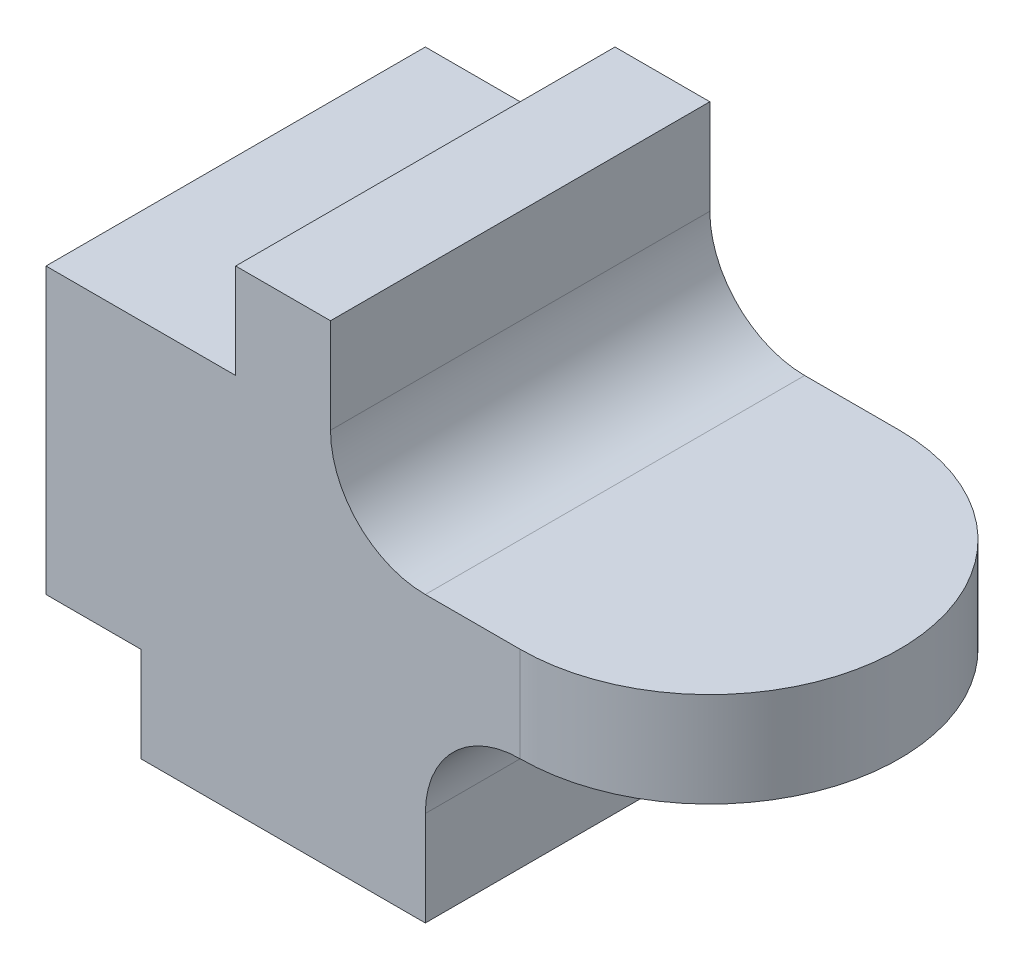
ISO-10303-21;
HEADER;
FILE_DESCRIPTION(('STEP AP214'),'2;1');
FILE_NAME('part.step','',(''),(''),'','','');
FILE_SCHEMA(('AUTOMOTIVE_DESIGN { 1 0 10303 214 1 1 1 1 }'));
ENDSEC;
DATA;
#1=APPLICATION_CONTEXT('core data for automotive mechanical design processes');
#2=APPLICATION_PROTOCOL_DEFINITION('international standard','automotive_design',2000,#1);
#3=PRODUCT_CONTEXT('',#1,'mechanical');
#4=PRODUCT('Part','Part','',(#3));
#5=PRODUCT_RELATED_PRODUCT_CATEGORY('part','',(#4));
#6=PRODUCT_DEFINITION_FORMATION('','',#4);
#7=PRODUCT_DEFINITION_CONTEXT('part definition',#1,'design');
#8=PRODUCT_DEFINITION('design','',#6,#7);
#9=PRODUCT_DEFINITION_SHAPE('','',#8);
#10=(LENGTH_UNIT() NAMED_UNIT(*) SI_UNIT(.MILLI.,.METRE.));
#11=(NAMED_UNIT(*) PLANE_ANGLE_UNIT() SI_UNIT($,.RADIAN.));
#12=(NAMED_UNIT(*) SI_UNIT($,.STERADIAN.) SOLID_ANGLE_UNIT());
#13=UNCERTAINTY_MEASURE_WITH_UNIT(LENGTH_MEASURE(1.E-05),#10,'distance_accuracy_value','');
#14=(GEOMETRIC_REPRESENTATION_CONTEXT(3) GLOBAL_UNCERTAINTY_ASSIGNED_CONTEXT((#13)) GLOBAL_UNIT_ASSIGNED_CONTEXT((#10,
#11,#12)) REPRESENTATION_CONTEXT('',''));
#15=CARTESIAN_POINT('',(0.,0.,0.));
#16=DIRECTION('',(0.,0.,1.));
#17=DIRECTION('',(1.,0.,0.));
#18=AXIS2_PLACEMENT_3D('',#15,#16,#17);
#19=CARTESIAN_POINT('',(0.,20.,-20.));
#20=DIRECTION('',(0.,1.,0.));
#21=DIRECTION('',(-1.,0.,0.));
#22=AXIS2_PLACEMENT_3D('',#19,#20,#21);
#23=PLANE('',#22);
#24=CARTESIAN_POINT('',(15.,20.,0.));
#25=DIRECTION('',(0.,1.,0.));
#26=DIRECTION('',(-1.,0.,0.));
#27=AXIS2_PLACEMENT_3D('',#24,#25,#26);
#28=CIRCLE('',#27,20.);
#29=CARTESIAN_POINT('',(15.,20.,-20.));
#30=VERTEX_POINT('',#29);
#31=CARTESIAN_POINT('',(15.,20.,20.));
#32=VERTEX_POINT('',#31);
#33=EDGE_CURVE('E188',#30,#32,#28,.F.);
#34=ORIENTED_EDGE('',*,*,#33,.T.);
#35=DIRECTION('',(0.,0.,1.));
#36=VECTOR('',#35,1.);
#37=CARTESIAN_POINT('',(15.,20.,-20.));
#38=LINE('',#37,#36);
#39=EDGE_CURVE('E170',#30,#32,#38,.T.);
#40=ORIENTED_EDGE('',*,*,#39,.F.);
#41=EDGE_LOOP('',(#34,#40));
#42=FACE_BOUND('',#41,.T.);
#43=ADVANCED_FACE('F33',(#42),#23,.F.);
#44=CARTESIAN_POINT('',(0.,30.,-20.));
#45=DIRECTION('',(0.,1.,0.));
#46=DIRECTION('',(-1.,0.,0.));
#47=AXIS2_PLACEMENT_3D('',#44,#45,#46);
#48=PLANE('',#47);
#49=DIRECTION('',(-1.,0.,0.));
#50=VECTOR('',#49,1.);
#51=CARTESIAN_POINT('',(0.,30.,20.));
#52=LINE('',#51,#50);
#53=CARTESIAN_POINT('',(15.,30.,20.));
#54=VERTEX_POINT('',#53);
#55=CARTESIAN_POINT('',(4.99999999999998,30.,20.));
#56=VERTEX_POINT('',#55);
#57=EDGE_CURVE('E137',#54,#56,#52,.T.);
#58=ORIENTED_EDGE('',*,*,#57,.F.);
#59=CARTESIAN_POINT('',(15.,30.,0.));
#60=DIRECTION('',(0.,1.,0.));
#61=DIRECTION('',(-1.,0.,0.));
#62=AXIS2_PLACEMENT_3D('',#59,#60,#61);
#63=CIRCLE('',#62,20.);
#64=CARTESIAN_POINT('',(15.,30.,-20.));
#65=VERTEX_POINT('',#64);
#66=EDGE_CURVE('E12',#65,#54,#63,.F.);
#67=ORIENTED_EDGE('',*,*,#66,.F.);
#68=DIRECTION('',(-1.,0.,0.));
#69=VECTOR('',#68,1.);
#70=CARTESIAN_POINT('',(0.,30.,-20.));
#71=LINE('',#70,#69);
#72=CARTESIAN_POINT('',(4.99999999999998,30.,-20.));
#73=VERTEX_POINT('',#72);
#74=EDGE_CURVE('E163',#65,#73,#71,.T.);
#75=ORIENTED_EDGE('',*,*,#74,.T.);
#76=DIRECTION('',(0.,0.,1.));
#77=VECTOR('',#76,1.);
#78=CARTESIAN_POINT('',(4.99999999999998,30.,-20.));
#79=LINE('',#78,#77);
#80=EDGE_CURVE('E145',#73,#56,#79,.T.);
#81=ORIENTED_EDGE('',*,*,#80,.T.);
#82=EDGE_LOOP('',(#58,#67,#75,#81));
#83=FACE_BOUND('',#82,.T.);
#84=ADVANCED_FACE('F143',(#83),#48,.T.);
#85=CARTESIAN_POINT('',(-35.,50.,20.));
#86=DIRECTION('',(0.,0.,-1.));
#87=DIRECTION('',(-1.,0.,0.));
#88=AXIS2_PLACEMENT_3D('',#85,#86,#87);
#89=PLANE('',#88);
#90=DIRECTION('',(0.,-1.,0.));
#91=VECTOR('',#90,1.);
#92=CARTESIAN_POINT('',(15.,50.,20.));
#93=LINE('',#92,#91);
#94=EDGE_CURVE('E128',#54,#32,#93,.T.);
#95=ORIENTED_EDGE('',*,*,#94,.F.);
#96=ORIENTED_EDGE('',*,*,#57,.T.);
#97=CARTESIAN_POINT('',(4.99999999999998,40.,20.));
#98=DIRECTION('',(0.,0.,1.));
#99=DIRECTION('',(1.,0.,0.));
#100=AXIS2_PLACEMENT_3D('',#97,#98,#99);
#101=CIRCLE('',#100,10.);
#102=CARTESIAN_POINT('',(-5.00000000000002,40.,20.));
#103=VERTEX_POINT('',#102);
#104=EDGE_CURVE('E148',#103,#56,#101,.T.);
#105=ORIENTED_EDGE('',*,*,#104,.F.);
#106=DIRECTION('',(0.,-1.,0.));
#107=VECTOR('',#106,1.);
#108=CARTESIAN_POINT('',(-5.00000000000002,0.,20.));
#109=LINE('',#108,#107);
#110=CARTESIAN_POINT('',(-5.00000000000002,50.,20.));
#111=VERTEX_POINT('',#110);
#112=EDGE_CURVE('E153',#111,#103,#109,.T.);
#113=ORIENTED_EDGE('',*,*,#112,.F.);
#114=DIRECTION('',(1.,0.,0.));
#115=VECTOR('',#114,1.);
#116=CARTESIAN_POINT('',(-35.,50.,20.));
#117=LINE('',#116,#115);
#118=CARTESIAN_POINT('',(-15.,50.,20.));
#119=VERTEX_POINT('',#118);
#120=EDGE_CURVE('E216',#119,#111,#117,.T.);
#121=ORIENTED_EDGE('',*,*,#120,.F.);
#122=DIRECTION('',(0.,-1.,0.));
#123=VECTOR('',#122,1.);
#124=CARTESIAN_POINT('',(-15.,0.,20.));
#125=LINE('',#124,#123);
#126=CARTESIAN_POINT('',(-15.,40.,20.));
#127=VERTEX_POINT('',#126);
#128=EDGE_CURVE('E159',#119,#127,#125,.T.);
#129=ORIENTED_EDGE('',*,*,#128,.T.);
#130=DIRECTION('',(1.,0.,0.));
#131=VECTOR('',#130,1.);
#132=CARTESIAN_POINT('',(0.,40.,20.));
#133=LINE('',#132,#131);
#134=CARTESIAN_POINT('',(-35.,40.,20.));
#135=VERTEX_POINT('',#134);
#136=EDGE_CURVE('E199',#135,#127,#133,.T.);
#137=ORIENTED_EDGE('',*,*,#136,.F.);
#138=DIRECTION('',(0.,-1.,0.));
#139=VECTOR('',#138,1.);
#140=CARTESIAN_POINT('',(-35.,50.,20.));
#141=LINE('',#140,#139);
#142=CARTESIAN_POINT('',(-35.,10.,20.));
#143=VERTEX_POINT('',#142);
#144=EDGE_CURVE('E220',#135,#143,#141,.T.);
#145=ORIENTED_EDGE('',*,*,#144,.T.);
#146=DIRECTION('',(1.,0.,0.));
#147=VECTOR('',#146,1.);
#148=CARTESIAN_POINT('',(0.,10.,20.));
#149=LINE('',#148,#147);
#150=CARTESIAN_POINT('',(-25.,10.,20.));
#151=VERTEX_POINT('',#150);
#152=EDGE_CURVE('E182',#143,#151,#149,.T.);
#153=ORIENTED_EDGE('',*,*,#152,.T.);
#154=DIRECTION('',(0.,1.,0.));
#155=VECTOR('',#154,1.);
#156=CARTESIAN_POINT('',(-25.,0.,20.));
#157=LINE('',#156,#155);
#158=CARTESIAN_POINT('',(-25.,0.,20.));
#159=VERTEX_POINT('',#158);
#160=EDGE_CURVE('E185',#159,#151,#157,.T.);
#161=ORIENTED_EDGE('',*,*,#160,.F.);
#162=DIRECTION('',(1.,0.,0.));
#163=VECTOR('',#162,1.);
#164=CARTESIAN_POINT('',(-35.,0.,20.));
#165=LINE('',#164,#163);
#166=CARTESIAN_POINT('',(4.99999999999999,0.,20.));
#167=VERTEX_POINT('',#166);
#168=EDGE_CURVE('E217',#159,#167,#165,.T.);
#169=ORIENTED_EDGE('',*,*,#168,.T.);
#170=DIRECTION('',(0.,1.,0.));
#171=VECTOR('',#170,1.);
#172=CARTESIAN_POINT('',(4.99999999999999,0.,20.));
#173=LINE('',#172,#171);
#174=CARTESIAN_POINT('',(4.99999999999999,10.,20.));
#175=VERTEX_POINT('',#174);
#176=EDGE_CURVE('E168',#167,#175,#173,.T.);
#177=ORIENTED_EDGE('',*,*,#176,.T.);
#178=CARTESIAN_POINT('',(15.,10.,20.));
#179=DIRECTION('',(0.,0.,1.));
#180=DIRECTION('',(1.,0.,0.));
#181=AXIS2_PLACEMENT_3D('',#178,#179,#180);
#182=CIRCLE('',#181,10.);
#183=EDGE_CURVE('E141',#32,#175,#182,.T.);
#184=ORIENTED_EDGE('',*,*,#183,.F.);
#185=EDGE_LOOP('',(#95,#96,#105,#113,#121,#129,#137,#145,#153,#161,#169,#177,#184));
#186=FACE_BOUND('',#185,.T.);
#187=ADVANCED_FACE('F135',(#186),#89,.F.);
#188=CARTESIAN_POINT('',(-35.,50.,-20.));
#189=DIRECTION('',(0.,0.,1.));
#190=DIRECTION('',(1.,0.,0.));
#191=AXIS2_PLACEMENT_3D('',#188,#189,#190);
#192=PLANE('',#191);
#193=DIRECTION('',(0.,-1.,0.));
#194=VECTOR('',#193,1.);
#195=CARTESIAN_POINT('',(15.,50.,-20.));
#196=LINE('',#195,#194);
#197=EDGE_CURVE('E47',#65,#30,#196,.T.);
#198=ORIENTED_EDGE('',*,*,#197,.T.);
#199=CARTESIAN_POINT('',(15.,10.,-20.));
#200=DIRECTION('',(0.,0.,1.));
#201=DIRECTION('',(1.,0.,0.));
#202=AXIS2_PLACEMENT_3D('',#199,#200,#201);
#203=CIRCLE('',#202,10.);
#204=CARTESIAN_POINT('',(4.99999999999999,10.,-20.));
#205=VERTEX_POINT('',#204);
#206=EDGE_CURVE('E164',#30,#205,#203,.T.);
#207=ORIENTED_EDGE('',*,*,#206,.T.);
#208=DIRECTION('',(0.,1.,0.));
#209=VECTOR('',#208,1.);
#210=CARTESIAN_POINT('',(4.99999999999999,0.,-20.));
#211=LINE('',#210,#209);
#212=CARTESIAN_POINT('',(4.99999999999999,0.,-20.));
#213=VERTEX_POINT('',#212);
#214=EDGE_CURVE('E167',#213,#205,#211,.T.);
#215=ORIENTED_EDGE('',*,*,#214,.F.);
#216=DIRECTION('',(-1.,0.,0.));
#217=VECTOR('',#216,1.);
#218=CARTESIAN_POINT('',(-35.,0.,-20.));
#219=LINE('',#218,#217);
#220=CARTESIAN_POINT('',(-25.,0.,-20.));
#221=VERTEX_POINT('',#220);
#222=EDGE_CURVE('E209',#213,#221,#219,.T.);
#223=ORIENTED_EDGE('',*,*,#222,.T.);
#224=DIRECTION('',(0.,1.,0.));
#225=VECTOR('',#224,1.);
#226=CARTESIAN_POINT('',(-25.,0.,-20.));
#227=LINE('',#226,#225);
#228=CARTESIAN_POINT('',(-25.,10.,-20.));
#229=VERTEX_POINT('',#228);
#230=EDGE_CURVE('E55',#221,#229,#227,.T.);
#231=ORIENTED_EDGE('',*,*,#230,.T.);
#232=DIRECTION('',(1.,0.,0.));
#233=VECTOR('',#232,1.);
#234=CARTESIAN_POINT('',(0.,10.,-20.));
#235=LINE('',#234,#233);
#236=CARTESIAN_POINT('',(-35.,10.,-20.));
#237=VERTEX_POINT('',#236);
#238=EDGE_CURVE('E181',#237,#229,#235,.T.);
#239=ORIENTED_EDGE('',*,*,#238,.F.);
#240=DIRECTION('',(0.,-1.,0.));
#241=VECTOR('',#240,1.);
#242=CARTESIAN_POINT('',(-35.,50.,-20.));
#243=LINE('',#242,#241);
#244=CARTESIAN_POINT('',(-35.,40.,-20.));
#245=VERTEX_POINT('',#244);
#246=EDGE_CURVE('E41',#245,#237,#243,.T.);
#247=ORIENTED_EDGE('',*,*,#246,.F.);
#248=DIRECTION('',(1.,0.,0.));
#249=VECTOR('',#248,1.);
#250=CARTESIAN_POINT('',(0.,40.,-20.));
#251=LINE('',#250,#249);
#252=CARTESIAN_POINT('',(-15.,40.,-20.));
#253=VERTEX_POINT('',#252);
#254=EDGE_CURVE('E198',#245,#253,#251,.T.);
#255=ORIENTED_EDGE('',*,*,#254,.T.);
#256=DIRECTION('',(0.,-1.,0.));
#257=VECTOR('',#256,1.);
#258=CARTESIAN_POINT('',(-15.,0.,-20.));
#259=LINE('',#258,#257);
#260=CARTESIAN_POINT('',(-15.,50.,-20.));
#261=VERTEX_POINT('',#260);
#262=EDGE_CURVE('E196',#261,#253,#259,.T.);
#263=ORIENTED_EDGE('',*,*,#262,.F.);
#264=DIRECTION('',(-1.,0.,0.));
#265=VECTOR('',#264,1.);
#266=CARTESIAN_POINT('',(-35.,50.,-20.));
#267=LINE('',#266,#265);
#268=CARTESIAN_POINT('',(-5.00000000000002,50.,-20.));
#269=VERTEX_POINT('',#268);
#270=EDGE_CURVE('E214',#269,#261,#267,.T.);
#271=ORIENTED_EDGE('',*,*,#270,.F.);
#272=DIRECTION('',(0.,-1.,0.));
#273=VECTOR('',#272,1.);
#274=CARTESIAN_POINT('',(-5.00000000000002,0.,-20.));
#275=LINE('',#274,#273);
#276=CARTESIAN_POINT('',(-5.00000000000002,40.,-20.));
#277=VERTEX_POINT('',#276);
#278=EDGE_CURVE('E147',#269,#277,#275,.T.);
#279=ORIENTED_EDGE('',*,*,#278,.T.);
#280=CARTESIAN_POINT('',(4.99999999999998,40.,-20.));
#281=DIRECTION('',(0.,0.,1.));
#282=DIRECTION('',(1.,0.,0.));
#283=AXIS2_PLACEMENT_3D('',#280,#281,#282);
#284=CIRCLE('',#283,10.);
#285=EDGE_CURVE('E151',#277,#73,#284,.T.);
#286=ORIENTED_EDGE('',*,*,#285,.T.);
#287=ORIENTED_EDGE('',*,*,#74,.F.);
#288=EDGE_LOOP('',(#198,#207,#215,#223,#231,#239,#247,#255,#263,#271,#279,#286,#287));
#289=FACE_BOUND('',#288,.T.);
#290=ADVANCED_FACE('F35',(#289),#192,.F.);
#291=CARTESIAN_POINT('',(-35.,50.,20.));
#292=DIRECTION('',(1.,0.,0.));
#293=DIRECTION('',(0.,0.,-1.));
#294=AXIS2_PLACEMENT_3D('',#291,#292,#293);
#295=PLANE('',#294);
#296=DIRECTION('',(0.,0.,1.));
#297=VECTOR('',#296,1.);
#298=CARTESIAN_POINT('',(-35.,10.,-20.));
#299=LINE('',#298,#297);
#300=EDGE_CURVE('E172',#237,#143,#299,.T.);
#301=ORIENTED_EDGE('',*,*,#300,.T.);
#302=ORIENTED_EDGE('',*,*,#144,.F.);
#303=DIRECTION('',(0.,0.,1.));
#304=VECTOR('',#303,1.);
#305=CARTESIAN_POINT('',(-35.,40.,-20.));
#306=LINE('',#305,#304);
#307=EDGE_CURVE('E210',#245,#135,#306,.T.);
#308=ORIENTED_EDGE('',*,*,#307,.F.);
#309=ORIENTED_EDGE('',*,*,#246,.T.);
#310=EDGE_LOOP('',(#301,#302,#308,#309));
#311=FACE_BOUND('',#310,.T.);
#312=ADVANCED_FACE('F230',(#311),#295,.F.);
#313=CARTESIAN_POINT('',(0.,0.,0.));
#314=DIRECTION('',(0.,-1.,0.));
#315=DIRECTION('',(0.,0.,-1.));
#316=AXIS2_PLACEMENT_3D('',#313,#314,#315);
#317=PLANE('',#316);
#318=ORIENTED_EDGE('',*,*,#222,.F.);
#319=DIRECTION('',(0.,0.,1.));
#320=VECTOR('',#319,1.);
#321=CARTESIAN_POINT('',(4.99999999999999,0.,-20.));
#322=LINE('',#321,#320);
#323=EDGE_CURVE('E174',#213,#167,#322,.T.);
#324=ORIENTED_EDGE('',*,*,#323,.T.);
#325=ORIENTED_EDGE('',*,*,#168,.F.);
#326=DIRECTION('',(0.,0.,1.));
#327=VECTOR('',#326,1.);
#328=CARTESIAN_POINT('',(-25.,0.,-20.));
#329=LINE('',#328,#327);
#330=EDGE_CURVE('E184',#221,#159,#329,.T.);
#331=ORIENTED_EDGE('',*,*,#330,.F.);
#332=EDGE_LOOP('',(#318,#324,#325,#331));
#333=FACE_BOUND('',#332,.T.);
#334=ADVANCED_FACE('F276',(#333),#317,.T.);
#335=CARTESIAN_POINT('',(0.,50.,0.));
#336=DIRECTION('',(0.,-1.,0.));
#337=DIRECTION('',(0.,0.,-1.));
#338=AXIS2_PLACEMENT_3D('',#335,#336,#337);
#339=PLANE('',#338);
#340=ORIENTED_EDGE('',*,*,#120,.T.);
#341=DIRECTION('',(0.,0.,1.));
#342=VECTOR('',#341,1.);
#343=CARTESIAN_POINT('',(-5.00000000000002,50.,-20.));
#344=LINE('',#343,#342);
#345=EDGE_CURVE('E157',#269,#111,#344,.T.);
#346=ORIENTED_EDGE('',*,*,#345,.F.);
#347=ORIENTED_EDGE('',*,*,#270,.T.);
#348=DIRECTION('',(0.,0.,1.));
#349=VECTOR('',#348,1.);
#350=CARTESIAN_POINT('',(-15.,50.,-20.));
#351=LINE('',#350,#349);
#352=EDGE_CURVE('E202',#261,#119,#351,.T.);
#353=ORIENTED_EDGE('',*,*,#352,.T.);
#354=EDGE_LOOP('',(#340,#346,#347,#353));
#355=FACE_BOUND('',#354,.T.);
#356=ADVANCED_FACE('F252',(#355),#339,.F.);
#357=CARTESIAN_POINT('',(-15.,0.,-20.));
#358=DIRECTION('',(-1.,0.,0.));
#359=DIRECTION('',(0.,-1.,0.));
#360=AXIS2_PLACEMENT_3D('',#357,#358,#359);
#361=PLANE('',#360);
#362=ORIENTED_EDGE('',*,*,#128,.F.);
#363=ORIENTED_EDGE('',*,*,#352,.F.);
#364=ORIENTED_EDGE('',*,*,#262,.T.);
#365=DIRECTION('',(0.,0.,1.));
#366=VECTOR('',#365,1.);
#367=CARTESIAN_POINT('',(-15.,40.,-20.));
#368=LINE('',#367,#366);
#369=EDGE_CURVE('E207',#253,#127,#368,.T.);
#370=ORIENTED_EDGE('',*,*,#369,.T.);
#371=EDGE_LOOP('',(#362,#363,#364,#370));
#372=FACE_BOUND('',#371,.T.);
#373=ADVANCED_FACE('F246',(#372),#361,.T.);
#374=CARTESIAN_POINT('',(0.,40.,-20.));
#375=DIRECTION('',(0.,-1.,0.));
#376=DIRECTION('',(0.,0.,-1.));
#377=AXIS2_PLACEMENT_3D('',#374,#375,#376);
#378=PLANE('',#377);
#379=ORIENTED_EDGE('',*,*,#136,.T.);
#380=ORIENTED_EDGE('',*,*,#369,.F.);
#381=ORIENTED_EDGE('',*,*,#254,.F.);
#382=ORIENTED_EDGE('',*,*,#307,.T.);
#383=EDGE_LOOP('',(#379,#380,#381,#382));
#384=FACE_BOUND('',#383,.T.);
#385=ADVANCED_FACE('F244',(#384),#378,.F.);
#386=CARTESIAN_POINT('',(0.,10.,-20.));
#387=DIRECTION('',(0.,-1.,0.));
#388=DIRECTION('',(0.,0.,-1.));
#389=AXIS2_PLACEMENT_3D('',#386,#387,#388);
#390=PLANE('',#389);
#391=ORIENTED_EDGE('',*,*,#152,.F.);
#392=ORIENTED_EDGE('',*,*,#300,.F.);
#393=ORIENTED_EDGE('',*,*,#238,.T.);
#394=DIRECTION('',(0.,0.,1.));
#395=VECTOR('',#394,1.);
#396=CARTESIAN_POINT('',(-25.,10.,-20.));
#397=LINE('',#396,#395);
#398=EDGE_CURVE('E193',#229,#151,#397,.T.);
#399=ORIENTED_EDGE('',*,*,#398,.T.);
#400=EDGE_LOOP('',(#391,#392,#393,#399));
#401=FACE_BOUND('',#400,.T.);
#402=ADVANCED_FACE('F236',(#401),#390,.T.);
#403=CARTESIAN_POINT('',(-25.,0.,-20.));
#404=DIRECTION('',(1.,0.,0.));
#405=DIRECTION('',(0.,0.,-1.));
#406=AXIS2_PLACEMENT_3D('',#403,#404,#405);
#407=PLANE('',#406);
#408=ORIENTED_EDGE('',*,*,#160,.T.);
#409=ORIENTED_EDGE('',*,*,#398,.F.);
#410=ORIENTED_EDGE('',*,*,#230,.F.);
#411=ORIENTED_EDGE('',*,*,#330,.T.);
#412=EDGE_LOOP('',(#408,#409,#410,#411));
#413=FACE_BOUND('',#412,.T.);
#414=ADVANCED_FACE('F237',(#413),#407,.F.);
#415=CARTESIAN_POINT('',(4.99999999999999,0.,-20.));
#416=DIRECTION('',(1.,0.,0.));
#417=DIRECTION('',(0.,0.,-1.));
#418=AXIS2_PLACEMENT_3D('',#415,#416,#417);
#419=PLANE('',#418);
#420=ORIENTED_EDGE('',*,*,#176,.F.);
#421=ORIENTED_EDGE('',*,*,#323,.F.);
#422=ORIENTED_EDGE('',*,*,#214,.T.);
#423=DIRECTION('',(0.,0.,1.));
#424=VECTOR('',#423,1.);
#425=CARTESIAN_POINT('',(4.99999999999999,10.,-20.));
#426=LINE('',#425,#424);
#427=EDGE_CURVE('E177',#205,#175,#426,.T.);
#428=ORIENTED_EDGE('',*,*,#427,.T.);
#429=EDGE_LOOP('',(#420,#421,#422,#428));
#430=FACE_BOUND('',#429,.T.);
#431=ADVANCED_FACE('F273',(#430),#419,.T.);
#432=CARTESIAN_POINT('',(15.,10.,-20.));
#433=DIRECTION('',(0.,0.,1.));
#434=DIRECTION('',(1.,0.,0.));
#435=AXIS2_PLACEMENT_3D('',#432,#433,#434);
#436=CYLINDRICAL_SURFACE('',#435,10.);
#437=ORIENTED_EDGE('',*,*,#183,.T.);
#438=ORIENTED_EDGE('',*,*,#427,.F.);
#439=ORIENTED_EDGE('',*,*,#206,.F.);
#440=ORIENTED_EDGE('',*,*,#39,.T.);
#441=EDGE_LOOP('',(#437,#438,#439,#440));
#442=FACE_BOUND('',#441,.T.);
#443=ADVANCED_FACE('F271',(#442),#436,.F.);
#444=CARTESIAN_POINT('',(-5.00000000000002,0.,-20.));
#445=DIRECTION('',(-1.,0.,0.));
#446=DIRECTION('',(0.,-1.,0.));
#447=AXIS2_PLACEMENT_3D('',#444,#445,#446);
#448=PLANE('',#447);
#449=ORIENTED_EDGE('',*,*,#112,.T.);
#450=DIRECTION('',(0.,0.,1.));
#451=VECTOR('',#450,1.);
#452=CARTESIAN_POINT('',(-5.00000000000002,40.,-20.));
#453=LINE('',#452,#451);
#454=EDGE_CURVE('E161',#277,#103,#453,.T.);
#455=ORIENTED_EDGE('',*,*,#454,.F.);
#456=ORIENTED_EDGE('',*,*,#278,.F.);
#457=ORIENTED_EDGE('',*,*,#345,.T.);
#458=EDGE_LOOP('',(#449,#455,#456,#457));
#459=FACE_BOUND('',#458,.T.);
#460=ADVANCED_FACE('F256',(#459),#448,.F.);
#461=CARTESIAN_POINT('',(4.99999999999998,40.,-20.));
#462=DIRECTION('',(0.,0.,1.));
#463=DIRECTION('',(1.,0.,0.));
#464=AXIS2_PLACEMENT_3D('',#461,#462,#463);
#465=CYLINDRICAL_SURFACE('',#464,10.);
#466=ORIENTED_EDGE('',*,*,#104,.T.);
#467=ORIENTED_EDGE('',*,*,#80,.F.);
#468=ORIENTED_EDGE('',*,*,#285,.F.);
#469=ORIENTED_EDGE('',*,*,#454,.T.);
#470=EDGE_LOOP('',(#466,#467,#468,#469));
#471=FACE_BOUND('',#470,.T.);
#472=ADVANCED_FACE('F335',(#471),#465,.F.);
#473=CARTESIAN_POINT('',(15.,50.,0.));
#474=DIRECTION('',(0.,-1.,0.));
#475=DIRECTION('',(0.,0.,-1.));
#476=AXIS2_PLACEMENT_3D('',#473,#474,#475);
#477=CYLINDRICAL_SURFACE('',#476,20.);
#478=ORIENTED_EDGE('',*,*,#197,.F.);
#479=ORIENTED_EDGE('',*,*,#66,.T.);
#480=ORIENTED_EDGE('',*,*,#94,.T.);
#481=ORIENTED_EDGE('',*,*,#33,.F.);
#482=EDGE_LOOP('',(#478,#479,#480,#481));
#483=FACE_BOUND('',#482,.T.);
#484=ADVANCED_FACE('F127',(#483),#477,.T.);
#485=CLOSED_SHELL('',(#43,#84,#187,#290,#312,#334,#356,#373,#385,#402,#414,#431,#443,#460,#472,#484));
#486=MANIFOLD_SOLID_BREP('B2',#485);
#487=ADVANCED_BREP_SHAPE_REPRESENTATION('',(#18,#486),#14);
#488=SHAPE_DEFINITION_REPRESENTATION(#9,#487);
ENDSEC;
END-ISO-10303-21;
